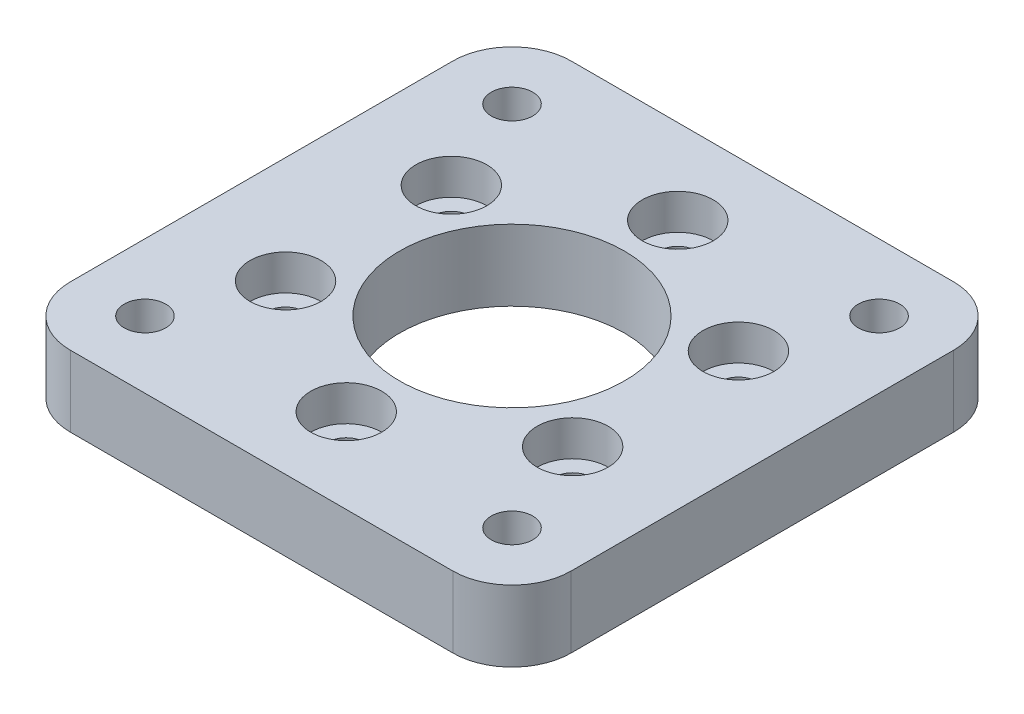
ISO-10303-21;
HEADER;
FILE_DESCRIPTION(('STEP AP214'),'2;1');
FILE_NAME('part.step','',(''),(''),'','','');
FILE_SCHEMA(('AUTOMOTIVE_DESIGN { 1 0 10303 214 1 1 1 1 }'));
ENDSEC;
DATA;
#1=APPLICATION_CONTEXT('core data for automotive mechanical design processes');
#2=APPLICATION_PROTOCOL_DEFINITION('international standard','automotive_design',2000,#1);
#3=PRODUCT_CONTEXT('',#1,'mechanical');
#4=PRODUCT('Part','Part','',(#3));
#5=PRODUCT_RELATED_PRODUCT_CATEGORY('part','',(#4));
#6=PRODUCT_DEFINITION_FORMATION('','',#4);
#7=PRODUCT_DEFINITION_CONTEXT('part definition',#1,'design');
#8=PRODUCT_DEFINITION('design','',#6,#7);
#9=PRODUCT_DEFINITION_SHAPE('','',#8);
#10=(LENGTH_UNIT() NAMED_UNIT(*) SI_UNIT(.MILLI.,.METRE.));
#11=(NAMED_UNIT(*) PLANE_ANGLE_UNIT() SI_UNIT($,.RADIAN.));
#12=(NAMED_UNIT(*) SI_UNIT($,.STERADIAN.) SOLID_ANGLE_UNIT());
#13=UNCERTAINTY_MEASURE_WITH_UNIT(LENGTH_MEASURE(1.E-05),#10,'distance_accuracy_value','');
#14=(GEOMETRIC_REPRESENTATION_CONTEXT(3) GLOBAL_UNCERTAINTY_ASSIGNED_CONTEXT((#13)) GLOBAL_UNIT_ASSIGNED_CONTEXT((#10,
#11,#12)) REPRESENTATION_CONTEXT('',''));
#15=CARTESIAN_POINT('',(0.,0.,0.));
#16=DIRECTION('',(0.,0.,1.));
#17=DIRECTION('',(1.,0.,0.));
#18=AXIS2_PLACEMENT_3D('',#15,#16,#17);
#19=CARTESIAN_POINT('',(-12.1243556529821,-3.,-7.00000000000014));
#20=DIRECTION('',(0.,1.,0.));
#21=DIRECTION('',(0.,0.,1.));
#22=AXIS2_PLACEMENT_3D('',#19,#20,#21);
#23=CYLINDRICAL_SURFACE('',#22,1.55);
#24=CARTESIAN_POINT('',(-12.1243556529821,-3.,-7.00000000000014));
#25=DIRECTION('',(0.,1.,0.));
#26=DIRECTION('',(0.866025403784433,0.,0.50000000000001));
#27=AXIS2_PLACEMENT_3D('',#24,#25,#26);
#28=CIRCLE('',#27,1.55);
#29=CARTESIAN_POINT('',(-10.7820162771162,-3.,-6.22500000000013));
#30=VERTEX_POINT('',#29);
#31=EDGE_CURVE('E168',#30,#30,#28,.T.);
#32=ORIENTED_EDGE('',*,*,#31,.F.);
#33=EDGE_LOOP('',(#32));
#34=FACE_BOUND('',#33,.T.);
#35=CARTESIAN_POINT('',(-12.1243556529821,0.,-7.00000000000014));
#36=DIRECTION('',(0.,1.,0.));
#37=DIRECTION('',(0.,0.,1.));
#38=AXIS2_PLACEMENT_3D('',#35,#36,#37);
#39=CIRCLE('',#38,1.55);
#40=CARTESIAN_POINT('',(-12.1243556529821,0.,-5.45000000000014));
#41=VERTEX_POINT('',#40);
#42=EDGE_CURVE('E40',#41,#41,#39,.F.);
#43=ORIENTED_EDGE('',*,*,#42,.F.);
#44=EDGE_LOOP('',(#43));
#45=FACE_BOUND('',#44,.T.);
#46=ADVANCED_FACE('F36',(#34,#45),#23,.F.);
#47=CARTESIAN_POINT('',(-12.1243556529822,-3.,6.99999999999989));
#48=DIRECTION('',(0.,1.,0.));
#49=DIRECTION('',(0.,0.,1.));
#50=AXIS2_PLACEMENT_3D('',#47,#48,#49);
#51=CYLINDRICAL_SURFACE('',#50,1.55);
#52=CARTESIAN_POINT('',(-12.1243556529822,-3.,6.99999999999989));
#53=DIRECTION('',(0.,1.,0.));
#54=DIRECTION('',(0.866025403784443,0.,-0.499999999999992));
#55=AXIS2_PLACEMENT_3D('',#52,#53,#54);
#56=CIRCLE('',#55,1.55);
#57=CARTESIAN_POINT('',(-10.7820162771163,-3.,6.2249999999999));
#58=VERTEX_POINT('',#57);
#59=EDGE_CURVE('E210',#58,#58,#56,.T.);
#60=ORIENTED_EDGE('',*,*,#59,.F.);
#61=EDGE_LOOP('',(#60));
#62=FACE_BOUND('',#61,.T.);
#63=CARTESIAN_POINT('',(-12.1243556529822,0.,6.99999999999989));
#64=DIRECTION('',(0.,1.,0.));
#65=DIRECTION('',(0.,0.,1.));
#66=AXIS2_PLACEMENT_3D('',#63,#64,#65);
#67=CIRCLE('',#66,1.55);
#68=CARTESIAN_POINT('',(-12.1243556529822,0.,8.54999999999989));
#69=VERTEX_POINT('',#68);
#70=EDGE_CURVE('E179',#69,#69,#67,.F.);
#71=ORIENTED_EDGE('',*,*,#70,.F.);
#72=EDGE_LOOP('',(#71));
#73=FACE_BOUND('',#72,.T.);
#74=ADVANCED_FACE('F287',(#62,#73),#51,.F.);
#75=CARTESIAN_POINT('',(0.,-3.,14.));
#76=DIRECTION('',(0.,1.,0.));
#77=DIRECTION('',(0.,0.,1.));
#78=AXIS2_PLACEMENT_3D('',#75,#76,#77);
#79=CYLINDRICAL_SURFACE('',#78,1.55);
#80=CARTESIAN_POINT('',(0.,-3.,14.));
#81=DIRECTION('',(0.,1.,0.));
#82=DIRECTION('',(0.,0.,-1.));
#83=AXIS2_PLACEMENT_3D('',#80,#81,#82);
#84=CIRCLE('',#83,1.55);
#85=CARTESIAN_POINT('',(0.,-3.,12.45));
#86=VERTEX_POINT('',#85);
#87=EDGE_CURVE('E213',#86,#86,#84,.T.);
#88=ORIENTED_EDGE('',*,*,#87,.F.);
#89=EDGE_LOOP('',(#88));
#90=FACE_BOUND('',#89,.T.);
#91=CARTESIAN_POINT('',(0.,0.,14.));
#92=DIRECTION('',(0.,1.,0.));
#93=DIRECTION('',(0.,0.,1.));
#94=AXIS2_PLACEMENT_3D('',#91,#92,#93);
#95=CIRCLE('',#94,1.55);
#96=CARTESIAN_POINT('',(0.,0.,15.55));
#97=VERTEX_POINT('',#96);
#98=EDGE_CURVE('E175',#97,#97,#95,.F.);
#99=ORIENTED_EDGE('',*,*,#98,.F.);
#100=EDGE_LOOP('',(#99));
#101=FACE_BOUND('',#100,.T.);
#102=ADVANCED_FACE('F293',(#90,#101),#79,.F.);
#103=CARTESIAN_POINT('',(12.1243556529821,-3.,7.00000000000006));
#104=DIRECTION('',(0.,1.,0.));
#105=DIRECTION('',(0.,0.,1.));
#106=AXIS2_PLACEMENT_3D('',#103,#104,#105);
#107=CYLINDRICAL_SURFACE('',#106,1.55);
#108=CARTESIAN_POINT('',(12.1243556529821,-3.,7.00000000000006));
#109=DIRECTION('',(0.,1.,0.));
#110=DIRECTION('',(-0.866025403784436,0.,-0.500000000000004));
#111=AXIS2_PLACEMENT_3D('',#108,#109,#110);
#112=CIRCLE('',#111,1.55);
#113=CARTESIAN_POINT('',(10.7820162771162,-3.,6.22500000000005));
#114=VERTEX_POINT('',#113);
#115=EDGE_CURVE('E216',#114,#114,#112,.T.);
#116=ORIENTED_EDGE('',*,*,#115,.F.);
#117=EDGE_LOOP('',(#116));
#118=FACE_BOUND('',#117,.T.);
#119=CARTESIAN_POINT('',(12.1243556529821,0.,7.00000000000006));
#120=DIRECTION('',(0.,1.,0.));
#121=DIRECTION('',(0.,0.,1.));
#122=AXIS2_PLACEMENT_3D('',#119,#120,#121);
#123=CIRCLE('',#122,1.55);
#124=CARTESIAN_POINT('',(12.1243556529821,0.,8.55000000000006));
#125=VERTEX_POINT('',#124);
#126=EDGE_CURVE('E170',#125,#125,#123,.F.);
#127=ORIENTED_EDGE('',*,*,#126,.F.);
#128=EDGE_LOOP('',(#127));
#129=FACE_BOUND('',#128,.T.);
#130=ADVANCED_FACE('F304',(#118,#129),#107,.F.);
#131=CARTESIAN_POINT('',(12.1243556529822,-3.,-6.99999999999997));
#132=DIRECTION('',(0.,1.,0.));
#133=DIRECTION('',(0.,0.,1.));
#134=AXIS2_PLACEMENT_3D('',#131,#132,#133);
#135=CYLINDRICAL_SURFACE('',#134,1.55);
#136=CARTESIAN_POINT('',(12.1243556529822,-3.,-6.99999999999997));
#137=DIRECTION('',(0.,1.,0.));
#138=DIRECTION('',(-0.86602540378444,0.,0.499999999999998));
#139=AXIS2_PLACEMENT_3D('',#136,#137,#138);
#140=CIRCLE('',#139,1.55);
#141=CARTESIAN_POINT('',(10.7820162771163,-3.,-6.22499999999998));
#142=VERTEX_POINT('',#141);
#143=EDGE_CURVE('E219',#142,#142,#140,.T.);
#144=ORIENTED_EDGE('',*,*,#143,.F.);
#145=EDGE_LOOP('',(#144));
#146=FACE_BOUND('',#145,.T.);
#147=CARTESIAN_POINT('',(12.1243556529822,0.,-6.99999999999997));
#148=DIRECTION('',(0.,1.,0.));
#149=DIRECTION('',(0.,0.,1.));
#150=AXIS2_PLACEMENT_3D('',#147,#148,#149);
#151=CIRCLE('',#150,1.55);
#152=CARTESIAN_POINT('',(12.1243556529822,0.,-5.44999999999997));
#153=VERTEX_POINT('',#152);
#154=EDGE_CURVE('E165',#153,#153,#151,.F.);
#155=ORIENTED_EDGE('',*,*,#154,.F.);
#156=EDGE_LOOP('',(#155));
#157=FACE_BOUND('',#156,.T.);
#158=ADVANCED_FACE('F308',(#146,#157),#135,.F.);
#159=CARTESIAN_POINT('',(0.,-3.,-14.));
#160=DIRECTION('',(0.,1.,0.));
#161=DIRECTION('',(0.,0.,1.));
#162=AXIS2_PLACEMENT_3D('',#159,#160,#161);
#163=CYLINDRICAL_SURFACE('',#162,1.55);
#164=CARTESIAN_POINT('',(0.,-3.,-14.));
#165=DIRECTION('',(0.,1.,0.));
#166=DIRECTION('',(0.,0.,1.));
#167=AXIS2_PLACEMENT_3D('',#164,#165,#166);
#168=CIRCLE('',#167,1.55);
#169=CARTESIAN_POINT('',(0.,-3.,-12.45));
#170=VERTEX_POINT('',#169);
#171=EDGE_CURVE('E163',#170,#170,#168,.T.);
#172=ORIENTED_EDGE('',*,*,#171,.F.);
#173=EDGE_LOOP('',(#172));
#174=FACE_BOUND('',#173,.T.);
#175=CARTESIAN_POINT('',(0.,0.,-14.));
#176=DIRECTION('',(0.,1.,0.));
#177=DIRECTION('',(0.,0.,1.));
#178=AXIS2_PLACEMENT_3D('',#175,#176,#177);
#179=CIRCLE('',#178,1.55);
#180=CARTESIAN_POINT('',(0.,0.,-12.45));
#181=VERTEX_POINT('',#180);
#182=EDGE_CURVE('E160',#181,#181,#179,.F.);
#183=ORIENTED_EDGE('',*,*,#182,.F.);
#184=EDGE_LOOP('',(#183));
#185=FACE_BOUND('',#184,.T.);
#186=ADVANCED_FACE('F312',(#174,#185),#163,.F.);
#187=CARTESIAN_POINT('',(21.15,3.,-21.15));
#188=DIRECTION('',(-1.,0.,0.));
#189=DIRECTION('',(0.,0.,1.));
#190=AXIS2_PLACEMENT_3D('',#187,#188,#189);
#191=PLANE('',#190);
#192=DIRECTION('',(0.,0.,-1.));
#193=VECTOR('',#192,1.);
#194=CARTESIAN_POINT('',(21.15,-3.,-21.15));
#195=LINE('',#194,#193);
#196=CARTESIAN_POINT('',(21.15,-3.,16.15));
#197=VERTEX_POINT('',#196);
#198=CARTESIAN_POINT('',(21.15,-3.,-16.15));
#199=VERTEX_POINT('',#198);
#200=EDGE_CURVE('E257',#197,#199,#195,.T.);
#201=ORIENTED_EDGE('',*,*,#200,.T.);
#202=DIRECTION('',(0.,-1.,0.));
#203=VECTOR('',#202,1.);
#204=CARTESIAN_POINT('',(21.15,3.,-16.15));
#205=LINE('',#204,#203);
#206=CARTESIAN_POINT('',(21.15,3.,-16.15));
#207=VERTEX_POINT('',#206);
#208=EDGE_CURVE('E11',#199,#207,#205,.F.);
#209=ORIENTED_EDGE('',*,*,#208,.T.);
#210=DIRECTION('',(0.,0.,-1.));
#211=VECTOR('',#210,1.);
#212=CARTESIAN_POINT('',(21.15,3.,-21.15));
#213=LINE('',#212,#211);
#214=CARTESIAN_POINT('',(21.15,3.,16.15));
#215=VERTEX_POINT('',#214);
#216=EDGE_CURVE('E130',#215,#207,#213,.T.);
#217=ORIENTED_EDGE('',*,*,#216,.F.);
#218=DIRECTION('',(0.,-1.,0.));
#219=VECTOR('',#218,1.);
#220=CARTESIAN_POINT('',(21.15,3.,16.15));
#221=LINE('',#220,#219);
#222=EDGE_CURVE('E45',#215,#197,#221,.T.);
#223=ORIENTED_EDGE('',*,*,#222,.T.);
#224=EDGE_LOOP('',(#201,#209,#217,#223));
#225=FACE_BOUND('',#224,.T.);
#226=ADVANCED_FACE('F284',(#225),#191,.F.);
#227=CARTESIAN_POINT('',(-21.15,3.,-21.15));
#228=DIRECTION('',(0.,0.,1.));
#229=DIRECTION('',(1.,0.,0.));
#230=AXIS2_PLACEMENT_3D('',#227,#228,#229);
#231=PLANE('',#230);
#232=DIRECTION('',(-1.,0.,0.));
#233=VECTOR('',#232,1.);
#234=CARTESIAN_POINT('',(-21.15,-3.,-21.15));
#235=LINE('',#234,#233);
#236=CARTESIAN_POINT('',(16.15,-3.,-21.15));
#237=VERTEX_POINT('',#236);
#238=CARTESIAN_POINT('',(-16.15,-3.,-21.15));
#239=VERTEX_POINT('',#238);
#240=EDGE_CURVE('E135',#237,#239,#235,.T.);
#241=ORIENTED_EDGE('',*,*,#240,.T.);
#242=DIRECTION('',(0.,-1.,0.));
#243=VECTOR('',#242,1.);
#244=CARTESIAN_POINT('',(-16.15,3.,-21.15));
#245=LINE('',#244,#243);
#246=CARTESIAN_POINT('',(-16.15,3.,-21.15));
#247=VERTEX_POINT('',#246);
#248=EDGE_CURVE('E53',#239,#247,#245,.F.);
#249=ORIENTED_EDGE('',*,*,#248,.T.);
#250=DIRECTION('',(-1.,0.,0.));
#251=VECTOR('',#250,1.);
#252=CARTESIAN_POINT('',(-21.15,3.,-21.15));
#253=LINE('',#252,#251);
#254=CARTESIAN_POINT('',(16.15,3.,-21.15));
#255=VERTEX_POINT('',#254);
#256=EDGE_CURVE('E133',#255,#247,#253,.T.);
#257=ORIENTED_EDGE('',*,*,#256,.F.);
#258=DIRECTION('',(0.,-1.,0.));
#259=VECTOR('',#258,1.);
#260=CARTESIAN_POINT('',(16.15,3.,-21.15));
#261=LINE('',#260,#259);
#262=EDGE_CURVE('E154',#255,#237,#261,.T.);
#263=ORIENTED_EDGE('',*,*,#262,.T.);
#264=EDGE_LOOP('',(#241,#249,#257,#263));
#265=FACE_BOUND('',#264,.T.);
#266=ADVANCED_FACE('F267',(#265),#231,.F.);
#267=CARTESIAN_POINT('',(-21.15,3.,-21.15));
#268=DIRECTION('',(1.,0.,0.));
#269=DIRECTION('',(0.,0.,-1.));
#270=AXIS2_PLACEMENT_3D('',#267,#268,#269);
#271=PLANE('',#270);
#272=DIRECTION('',(0.,0.,1.));
#273=VECTOR('',#272,1.);
#274=CARTESIAN_POINT('',(-21.15,-3.,-21.15));
#275=LINE('',#274,#273);
#276=CARTESIAN_POINT('',(-21.15,-3.,-16.15));
#277=VERTEX_POINT('',#276);
#278=CARTESIAN_POINT('',(-21.15,-3.,16.15));
#279=VERTEX_POINT('',#278);
#280=EDGE_CURVE('E131',#277,#279,#275,.T.);
#281=ORIENTED_EDGE('',*,*,#280,.T.);
#282=DIRECTION('',(0.,-1.,0.));
#283=VECTOR('',#282,1.);
#284=CARTESIAN_POINT('',(-21.15,3.,16.15));
#285=LINE('',#284,#283);
#286=CARTESIAN_POINT('',(-21.15,3.,16.15));
#287=VERTEX_POINT('',#286);
#288=EDGE_CURVE('E109',#279,#287,#285,.F.);
#289=ORIENTED_EDGE('',*,*,#288,.T.);
#290=DIRECTION('',(0.,0.,1.));
#291=VECTOR('',#290,1.);
#292=CARTESIAN_POINT('',(-21.15,3.,-21.15));
#293=LINE('',#292,#291);
#294=CARTESIAN_POINT('',(-21.15,3.,-16.15));
#295=VERTEX_POINT('',#294);
#296=EDGE_CURVE('E261',#295,#287,#293,.T.);
#297=ORIENTED_EDGE('',*,*,#296,.F.);
#298=DIRECTION('',(0.,-1.,0.));
#299=VECTOR('',#298,1.);
#300=CARTESIAN_POINT('',(-21.15,3.,-16.15));
#301=LINE('',#300,#299);
#302=EDGE_CURVE('E114',#295,#277,#301,.T.);
#303=ORIENTED_EDGE('',*,*,#302,.T.);
#304=EDGE_LOOP('',(#281,#289,#297,#303));
#305=FACE_BOUND('',#304,.T.);
#306=ADVANCED_FACE('F276',(#305),#271,.F.);
#307=CARTESIAN_POINT('',(-21.15,3.,21.15));
#308=DIRECTION('',(0.,0.,-1.));
#309=DIRECTION('',(-1.,0.,0.));
#310=AXIS2_PLACEMENT_3D('',#307,#308,#309);
#311=PLANE('',#310);
#312=DIRECTION('',(1.,0.,0.));
#313=VECTOR('',#312,1.);
#314=CARTESIAN_POINT('',(-21.15,3.,21.15));
#315=LINE('',#314,#313);
#316=CARTESIAN_POINT('',(-16.15,3.,21.15));
#317=VERTEX_POINT('',#316);
#318=CARTESIAN_POINT('',(16.15,3.,21.15));
#319=VERTEX_POINT('',#318);
#320=EDGE_CURVE('E124',#317,#319,#315,.T.);
#321=ORIENTED_EDGE('',*,*,#320,.F.);
#322=DIRECTION('',(0.,-1.,0.));
#323=VECTOR('',#322,1.);
#324=CARTESIAN_POINT('',(-16.15,3.,21.15));
#325=LINE('',#324,#323);
#326=CARTESIAN_POINT('',(-16.15,-3.,21.15));
#327=VERTEX_POINT('',#326);
#328=EDGE_CURVE('E108',#317,#327,#325,.T.);
#329=ORIENTED_EDGE('',*,*,#328,.T.);
#330=DIRECTION('',(1.,0.,0.));
#331=VECTOR('',#330,1.);
#332=CARTESIAN_POINT('',(-21.15,-3.,21.15));
#333=LINE('',#332,#331);
#334=CARTESIAN_POINT('',(16.15,-3.,21.15));
#335=VERTEX_POINT('',#334);
#336=EDGE_CURVE('E121',#327,#335,#333,.T.);
#337=ORIENTED_EDGE('',*,*,#336,.T.);
#338=DIRECTION('',(0.,-1.,0.));
#339=VECTOR('',#338,1.);
#340=CARTESIAN_POINT('',(16.15,3.,21.15));
#341=LINE('',#340,#339);
#342=EDGE_CURVE('E126',#335,#319,#341,.F.);
#343=ORIENTED_EDGE('',*,*,#342,.T.);
#344=EDGE_LOOP('',(#321,#329,#337,#343));
#345=FACE_BOUND('',#344,.T.);
#346=ADVANCED_FACE('F120',(#345),#311,.F.);
#347=CARTESIAN_POINT('',(0.,3.,0.));
#348=DIRECTION('',(0.,1.,0.));
#349=DIRECTION('',(0.,0.,1.));
#350=AXIS2_PLACEMENT_3D('',#347,#348,#349);
#351=PLANE('',#350);
#352=CARTESIAN_POINT('',(-12.1243556529821,3.,-7.00000000000014));
#353=DIRECTION('',(0.,1.,0.));
#354=DIRECTION('',(0.866025403784433,0.,0.50000000000001));
#355=AXIS2_PLACEMENT_3D('',#352,#353,#354);
#356=CIRCLE('',#355,3.);
#357=CARTESIAN_POINT('',(-9.52627944162876,3.,-5.50000000000011));
#358=VERTEX_POINT('',#357);
#359=EDGE_CURVE('E195',#358,#358,#356,.T.);
#360=ORIENTED_EDGE('',*,*,#359,.F.);
#361=EDGE_LOOP('',(#360));
#362=FACE_BOUND('',#361,.T.);
#363=CARTESIAN_POINT('',(-12.1243556529822,3.,6.99999999999989));
#364=DIRECTION('',(0.,1.,0.));
#365=DIRECTION('',(0.866025403784443,0.,-0.499999999999992));
#366=AXIS2_PLACEMENT_3D('',#363,#364,#365);
#367=CIRCLE('',#366,3.);
#368=CARTESIAN_POINT('',(-9.52627944162888,3.,5.49999999999991));
#369=VERTEX_POINT('',#368);
#370=EDGE_CURVE('E188',#369,#369,#367,.T.);
#371=ORIENTED_EDGE('',*,*,#370,.F.);
#372=EDGE_LOOP('',(#371));
#373=FACE_BOUND('',#372,.T.);
#374=CARTESIAN_POINT('',(0.,3.,14.));
#375=DIRECTION('',(0.,1.,0.));
#376=DIRECTION('',(0.,0.,-1.));
#377=AXIS2_PLACEMENT_3D('',#374,#375,#376);
#378=CIRCLE('',#377,3.);
#379=CARTESIAN_POINT('',(0.,3.,11.));
#380=VERTEX_POINT('',#379);
#381=EDGE_CURVE('E181',#380,#380,#378,.T.);
#382=ORIENTED_EDGE('',*,*,#381,.F.);
#383=EDGE_LOOP('',(#382));
#384=FACE_BOUND('',#383,.T.);
#385=CARTESIAN_POINT('',(12.1243556529821,3.,7.00000000000006));
#386=DIRECTION('',(0.,1.,0.));
#387=DIRECTION('',(-0.866025403784436,0.,-0.500000000000004));
#388=AXIS2_PLACEMENT_3D('',#385,#386,#387);
#389=CIRCLE('',#388,3.);
#390=CARTESIAN_POINT('',(9.5262794416288,3.,5.50000000000004));
#391=VERTEX_POINT('',#390);
#392=EDGE_CURVE('E177',#391,#391,#389,.T.);
#393=ORIENTED_EDGE('',*,*,#392,.F.);
#394=EDGE_LOOP('',(#393));
#395=FACE_BOUND('',#394,.T.);
#396=CARTESIAN_POINT('',(12.1243556529822,3.,-6.99999999999997));
#397=DIRECTION('',(0.,1.,0.));
#398=DIRECTION('',(-0.86602540378444,0.,0.499999999999998));
#399=AXIS2_PLACEMENT_3D('',#396,#397,#398);
#400=CIRCLE('',#399,3.);
#401=CARTESIAN_POINT('',(9.52627944162884,3.,-5.49999999999998));
#402=VERTEX_POINT('',#401);
#403=EDGE_CURVE('E173',#402,#402,#400,.T.);
#404=ORIENTED_EDGE('',*,*,#403,.F.);
#405=EDGE_LOOP('',(#404));
#406=FACE_BOUND('',#405,.T.);
#407=CARTESIAN_POINT('',(0.,3.,-14.));
#408=DIRECTION('',(0.,1.,0.));
#409=DIRECTION('',(0.,0.,1.));
#410=AXIS2_PLACEMENT_3D('',#407,#408,#409);
#411=CIRCLE('',#410,3.);
#412=CARTESIAN_POINT('',(0.,3.,-11.));
#413=VERTEX_POINT('',#412);
#414=EDGE_CURVE('E222',#413,#413,#411,.T.);
#415=ORIENTED_EDGE('',*,*,#414,.F.);
#416=EDGE_LOOP('',(#415));
#417=FACE_BOUND('',#416,.T.);
#418=CARTESIAN_POINT('',(0.,3.,0.));
#419=DIRECTION('',(0.,-1.,0.));
#420=DIRECTION('',(0.,0.,-1.));
#421=AXIS2_PLACEMENT_3D('',#418,#419,#420);
#422=CIRCLE('',#421,9.5);
#423=CARTESIAN_POINT('',(0.,3.,-9.5));
#424=VERTEX_POINT('',#423);
#425=EDGE_CURVE('E230',#424,#424,#422,.T.);
#426=ORIENTED_EDGE('',*,*,#425,.T.);
#427=EDGE_LOOP('',(#426));
#428=FACE_BOUND('',#427,.T.);
#429=CARTESIAN_POINT('',(-15.5,3.,-15.5));
#430=DIRECTION('',(0.,-1.,0.));
#431=DIRECTION('',(0.,0.,-1.));
#432=AXIS2_PLACEMENT_3D('',#429,#430,#431);
#433=CIRCLE('',#432,1.75);
#434=CARTESIAN_POINT('',(-15.5,3.,-17.25));
#435=VERTEX_POINT('',#434);
#436=EDGE_CURVE('E236',#435,#435,#433,.T.);
#437=ORIENTED_EDGE('',*,*,#436,.T.);
#438=EDGE_LOOP('',(#437));
#439=FACE_BOUND('',#438,.T.);
#440=CARTESIAN_POINT('',(15.5,3.,-15.5));
#441=DIRECTION('',(0.,-1.,0.));
#442=DIRECTION('',(0.,0.,-1.));
#443=AXIS2_PLACEMENT_3D('',#440,#441,#442);
#444=CIRCLE('',#443,1.75);
#445=CARTESIAN_POINT('',(15.5,3.,-17.25));
#446=VERTEX_POINT('',#445);
#447=EDGE_CURVE('E242',#446,#446,#444,.T.);
#448=ORIENTED_EDGE('',*,*,#447,.T.);
#449=EDGE_LOOP('',(#448));
#450=FACE_BOUND('',#449,.T.);
#451=CARTESIAN_POINT('',(15.5,3.,15.5));
#452=DIRECTION('',(0.,-1.,0.));
#453=DIRECTION('',(0.,0.,-1.));
#454=AXIS2_PLACEMENT_3D('',#451,#452,#453);
#455=CIRCLE('',#454,1.75);
#456=CARTESIAN_POINT('',(15.5,3.,13.75));
#457=VERTEX_POINT('',#456);
#458=EDGE_CURVE('E248',#457,#457,#455,.T.);
#459=ORIENTED_EDGE('',*,*,#458,.T.);
#460=EDGE_LOOP('',(#459));
#461=FACE_BOUND('',#460,.T.);
#462=CARTESIAN_POINT('',(-15.5,3.,15.5));
#463=DIRECTION('',(0.,-1.,0.));
#464=DIRECTION('',(0.,0.,-1.));
#465=AXIS2_PLACEMENT_3D('',#462,#463,#464);
#466=CIRCLE('',#465,1.75);
#467=CARTESIAN_POINT('',(-15.5,3.,13.75));
#468=VERTEX_POINT('',#467);
#469=EDGE_CURVE('E254',#468,#468,#466,.T.);
#470=ORIENTED_EDGE('',*,*,#469,.T.);
#471=EDGE_LOOP('',(#470));
#472=FACE_BOUND('',#471,.T.);
#473=ORIENTED_EDGE('',*,*,#296,.T.);
#474=CARTESIAN_POINT('',(-16.15,3.,16.15));
#475=DIRECTION('',(0.,1.,0.));
#476=DIRECTION('',(0.,0.,1.));
#477=AXIS2_PLACEMENT_3D('',#474,#475,#476);
#478=CIRCLE('',#477,5.);
#479=EDGE_CURVE('E152',#287,#317,#478,.T.);
#480=ORIENTED_EDGE('',*,*,#479,.T.);
#481=ORIENTED_EDGE('',*,*,#320,.T.);
#482=CARTESIAN_POINT('',(16.15,3.,16.15));
#483=DIRECTION('',(0.,1.,0.));
#484=DIRECTION('',(0.,0.,1.));
#485=AXIS2_PLACEMENT_3D('',#482,#483,#484);
#486=CIRCLE('',#485,5.);
#487=EDGE_CURVE('E147',#319,#215,#486,.T.);
#488=ORIENTED_EDGE('',*,*,#487,.T.);
#489=ORIENTED_EDGE('',*,*,#216,.T.);
#490=CARTESIAN_POINT('',(16.15,3.,-16.15));
#491=DIRECTION('',(0.,1.,0.));
#492=DIRECTION('',(0.,0.,1.));
#493=AXIS2_PLACEMENT_3D('',#490,#491,#492);
#494=CIRCLE('',#493,5.);
#495=EDGE_CURVE('E60',#207,#255,#494,.T.);
#496=ORIENTED_EDGE('',*,*,#495,.T.);
#497=ORIENTED_EDGE('',*,*,#256,.T.);
#498=CARTESIAN_POINT('',(-16.15,3.,-16.15));
#499=DIRECTION('',(0.,1.,0.));
#500=DIRECTION('',(0.,0.,1.));
#501=AXIS2_PLACEMENT_3D('',#498,#499,#500);
#502=CIRCLE('',#501,5.);
#503=EDGE_CURVE('E150',#247,#295,#502,.T.);
#504=ORIENTED_EDGE('',*,*,#503,.T.);
#505=EDGE_LOOP('',(#473,#480,#481,#488,#489,#496,#497,#504));
#506=FACE_BOUND('',#505,.T.);
#507=ADVANCED_FACE('F274',(#362,#373,#384,#395,#406,#417,#428,#439,#450,#461,#472,#506),#351,.T.);
#508=CARTESIAN_POINT('',(0.,-3.,0.));
#509=DIRECTION('',(0.,1.,0.));
#510=DIRECTION('',(0.,0.,1.));
#511=AXIS2_PLACEMENT_3D('',#508,#509,#510);
#512=PLANE('',#511);
#513=ORIENTED_EDGE('',*,*,#31,.T.);
#514=EDGE_LOOP('',(#513));
#515=FACE_BOUND('',#514,.T.);
#516=ORIENTED_EDGE('',*,*,#59,.T.);
#517=EDGE_LOOP('',(#516));
#518=FACE_BOUND('',#517,.T.);
#519=ORIENTED_EDGE('',*,*,#87,.T.);
#520=EDGE_LOOP('',(#519));
#521=FACE_BOUND('',#520,.T.);
#522=ORIENTED_EDGE('',*,*,#115,.T.);
#523=EDGE_LOOP('',(#522));
#524=FACE_BOUND('',#523,.T.);
#525=ORIENTED_EDGE('',*,*,#143,.T.);
#526=EDGE_LOOP('',(#525));
#527=FACE_BOUND('',#526,.T.);
#528=ORIENTED_EDGE('',*,*,#171,.T.);
#529=EDGE_LOOP('',(#528));
#530=FACE_BOUND('',#529,.T.);
#531=CARTESIAN_POINT('',(0.,-3.,0.));
#532=DIRECTION('',(0.,-1.,0.));
#533=DIRECTION('',(0.,0.,-1.));
#534=AXIS2_PLACEMENT_3D('',#531,#532,#533);
#535=CIRCLE('',#534,9.5);
#536=CARTESIAN_POINT('',(0.,-3.,-9.5));
#537=VERTEX_POINT('',#536);
#538=EDGE_CURVE('E229',#537,#537,#535,.T.);
#539=ORIENTED_EDGE('',*,*,#538,.F.);
#540=EDGE_LOOP('',(#539));
#541=FACE_BOUND('',#540,.T.);
#542=CARTESIAN_POINT('',(-15.5,-3.,-15.5));
#543=DIRECTION('',(0.,-1.,0.));
#544=DIRECTION('',(0.,0.,-1.));
#545=AXIS2_PLACEMENT_3D('',#542,#543,#544);
#546=CIRCLE('',#545,1.75);
#547=CARTESIAN_POINT('',(-15.5,-3.,-17.25));
#548=VERTEX_POINT('',#547);
#549=EDGE_CURVE('E233',#548,#548,#546,.T.);
#550=ORIENTED_EDGE('',*,*,#549,.F.);
#551=EDGE_LOOP('',(#550));
#552=FACE_BOUND('',#551,.T.);
#553=CARTESIAN_POINT('',(15.5,-3.,-15.5));
#554=DIRECTION('',(0.,-1.,0.));
#555=DIRECTION('',(0.,0.,-1.));
#556=AXIS2_PLACEMENT_3D('',#553,#554,#555);
#557=CIRCLE('',#556,1.75);
#558=CARTESIAN_POINT('',(15.5,-3.,-17.25));
#559=VERTEX_POINT('',#558);
#560=EDGE_CURVE('E239',#559,#559,#557,.T.);
#561=ORIENTED_EDGE('',*,*,#560,.F.);
#562=EDGE_LOOP('',(#561));
#563=FACE_BOUND('',#562,.T.);
#564=CARTESIAN_POINT('',(15.5,-3.,15.5));
#565=DIRECTION('',(0.,-1.,0.));
#566=DIRECTION('',(0.,0.,-1.));
#567=AXIS2_PLACEMENT_3D('',#564,#565,#566);
#568=CIRCLE('',#567,1.75);
#569=CARTESIAN_POINT('',(15.5,-3.,13.75));
#570=VERTEX_POINT('',#569);
#571=EDGE_CURVE('E245',#570,#570,#568,.T.);
#572=ORIENTED_EDGE('',*,*,#571,.F.);
#573=EDGE_LOOP('',(#572));
#574=FACE_BOUND('',#573,.T.);
#575=CARTESIAN_POINT('',(-15.5,-3.,15.5));
#576=DIRECTION('',(0.,-1.,0.));
#577=DIRECTION('',(0.,0.,-1.));
#578=AXIS2_PLACEMENT_3D('',#575,#576,#577);
#579=CIRCLE('',#578,1.75);
#580=CARTESIAN_POINT('',(-15.5,-3.,13.75));
#581=VERTEX_POINT('',#580);
#582=EDGE_CURVE('E251',#581,#581,#579,.T.);
#583=ORIENTED_EDGE('',*,*,#582,.F.);
#584=EDGE_LOOP('',(#583));
#585=FACE_BOUND('',#584,.T.);
#586=ORIENTED_EDGE('',*,*,#336,.F.);
#587=CARTESIAN_POINT('',(-16.15,-3.,16.15));
#588=DIRECTION('',(0.,1.,0.));
#589=DIRECTION('',(0.,0.,1.));
#590=AXIS2_PLACEMENT_3D('',#587,#588,#589);
#591=CIRCLE('',#590,5.);
#592=EDGE_CURVE('E104',#327,#279,#591,.F.);
#593=ORIENTED_EDGE('',*,*,#592,.T.);
#594=ORIENTED_EDGE('',*,*,#280,.F.);
#595=CARTESIAN_POINT('',(-16.15,-3.,-16.15));
#596=DIRECTION('',(0.,1.,0.));
#597=DIRECTION('',(0.,0.,1.));
#598=AXIS2_PLACEMENT_3D('',#595,#596,#597);
#599=CIRCLE('',#598,5.);
#600=EDGE_CURVE('E115',#277,#239,#599,.F.);
#601=ORIENTED_EDGE('',*,*,#600,.T.);
#602=ORIENTED_EDGE('',*,*,#240,.F.);
#603=CARTESIAN_POINT('',(16.15,-3.,-16.15));
#604=DIRECTION('',(0.,1.,0.));
#605=DIRECTION('',(0.,0.,1.));
#606=AXIS2_PLACEMENT_3D('',#603,#604,#605);
#607=CIRCLE('',#606,5.);
#608=EDGE_CURVE('E141',#237,#199,#607,.F.);
#609=ORIENTED_EDGE('',*,*,#608,.T.);
#610=ORIENTED_EDGE('',*,*,#200,.F.);
#611=CARTESIAN_POINT('',(16.15,-3.,16.15));
#612=DIRECTION('',(0.,1.,0.));
#613=DIRECTION('',(0.,0.,1.));
#614=AXIS2_PLACEMENT_3D('',#611,#612,#613);
#615=CIRCLE('',#614,5.);
#616=EDGE_CURVE('E125',#197,#335,#615,.F.);
#617=ORIENTED_EDGE('',*,*,#616,.T.);
#618=EDGE_LOOP('',(#586,#593,#594,#601,#602,#609,#610,#617));
#619=FACE_BOUND('',#618,.T.);
#620=ADVANCED_FACE('F128',(#515,#518,#521,#524,#527,#530,#541,#552,#563,#574,#585,#619),#512,.F.);
#621=CARTESIAN_POINT('',(-16.15,3.,16.15));
#622=DIRECTION('',(0.,-1.,0.));
#623=DIRECTION('',(0.,0.,-1.));
#624=AXIS2_PLACEMENT_3D('',#621,#622,#623);
#625=CYLINDRICAL_SURFACE('',#624,5.);
#626=ORIENTED_EDGE('',*,*,#479,.F.);
#627=ORIENTED_EDGE('',*,*,#288,.F.);
#628=ORIENTED_EDGE('',*,*,#592,.F.);
#629=ORIENTED_EDGE('',*,*,#328,.F.);
#630=EDGE_LOOP('',(#626,#627,#628,#629));
#631=FACE_BOUND('',#630,.T.);
#632=ADVANCED_FACE('F107',(#631),#625,.T.);
#633=CARTESIAN_POINT('',(-16.15,3.,-16.15));
#634=DIRECTION('',(0.,-1.,0.));
#635=DIRECTION('',(0.,0.,-1.));
#636=AXIS2_PLACEMENT_3D('',#633,#634,#635);
#637=CYLINDRICAL_SURFACE('',#636,5.);
#638=ORIENTED_EDGE('',*,*,#503,.F.);
#639=ORIENTED_EDGE('',*,*,#248,.F.);
#640=ORIENTED_EDGE('',*,*,#600,.F.);
#641=ORIENTED_EDGE('',*,*,#302,.F.);
#642=EDGE_LOOP('',(#638,#639,#640,#641));
#643=FACE_BOUND('',#642,.T.);
#644=ADVANCED_FACE('F271',(#643),#637,.T.);
#645=CARTESIAN_POINT('',(16.15,3.,-16.15));
#646=DIRECTION('',(0.,-1.,0.));
#647=DIRECTION('',(0.,0.,-1.));
#648=AXIS2_PLACEMENT_3D('',#645,#646,#647);
#649=CYLINDRICAL_SURFACE('',#648,5.);
#650=ORIENTED_EDGE('',*,*,#495,.F.);
#651=ORIENTED_EDGE('',*,*,#208,.F.);
#652=ORIENTED_EDGE('',*,*,#608,.F.);
#653=ORIENTED_EDGE('',*,*,#262,.F.);
#654=EDGE_LOOP('',(#650,#651,#652,#653));
#655=FACE_BOUND('',#654,.T.);
#656=ADVANCED_FACE('F580',(#655),#649,.T.);
#657=CARTESIAN_POINT('',(16.15,3.,16.15));
#658=DIRECTION('',(0.,-1.,0.));
#659=DIRECTION('',(0.,0.,-1.));
#660=AXIS2_PLACEMENT_3D('',#657,#658,#659);
#661=CYLINDRICAL_SURFACE('',#660,5.);
#662=ORIENTED_EDGE('',*,*,#487,.F.);
#663=ORIENTED_EDGE('',*,*,#342,.F.);
#664=ORIENTED_EDGE('',*,*,#616,.F.);
#665=ORIENTED_EDGE('',*,*,#222,.F.);
#666=EDGE_LOOP('',(#662,#663,#664,#665));
#667=FACE_BOUND('',#666,.T.);
#668=ADVANCED_FACE('F38',(#667),#661,.T.);
#669=CARTESIAN_POINT('',(-15.5,3.,15.5));
#670=DIRECTION('',(0.,-1.,0.));
#671=DIRECTION('',(0.,0.,-1.));
#672=AXIS2_PLACEMENT_3D('',#669,#670,#671);
#673=CYLINDRICAL_SURFACE('',#672,1.75);
#674=ORIENTED_EDGE('',*,*,#469,.F.);
#675=EDGE_LOOP('',(#674));
#676=FACE_BOUND('',#675,.T.);
#677=ORIENTED_EDGE('',*,*,#582,.T.);
#678=EDGE_LOOP('',(#677));
#679=FACE_BOUND('',#678,.T.);
#680=ADVANCED_FACE('F341',(#676,#679),#673,.F.);
#681=CARTESIAN_POINT('',(15.5,3.,15.5));
#682=DIRECTION('',(0.,-1.,0.));
#683=DIRECTION('',(0.,0.,-1.));
#684=AXIS2_PLACEMENT_3D('',#681,#682,#683);
#685=CYLINDRICAL_SURFACE('',#684,1.75);
#686=ORIENTED_EDGE('',*,*,#458,.F.);
#687=EDGE_LOOP('',(#686));
#688=FACE_BOUND('',#687,.T.);
#689=ORIENTED_EDGE('',*,*,#571,.T.);
#690=EDGE_LOOP('',(#689));
#691=FACE_BOUND('',#690,.T.);
#692=ADVANCED_FACE('F337',(#688,#691),#685,.F.);
#693=CARTESIAN_POINT('',(15.5,3.,-15.5));
#694=DIRECTION('',(0.,-1.,0.));
#695=DIRECTION('',(0.,0.,-1.));
#696=AXIS2_PLACEMENT_3D('',#693,#694,#695);
#697=CYLINDRICAL_SURFACE('',#696,1.75);
#698=ORIENTED_EDGE('',*,*,#447,.F.);
#699=EDGE_LOOP('',(#698));
#700=FACE_BOUND('',#699,.T.);
#701=ORIENTED_EDGE('',*,*,#560,.T.);
#702=EDGE_LOOP('',(#701));
#703=FACE_BOUND('',#702,.T.);
#704=ADVANCED_FACE('F333',(#700,#703),#697,.F.);
#705=CARTESIAN_POINT('',(-15.5,3.,-15.5));
#706=DIRECTION('',(0.,-1.,0.));
#707=DIRECTION('',(0.,0.,-1.));
#708=AXIS2_PLACEMENT_3D('',#705,#706,#707);
#709=CYLINDRICAL_SURFACE('',#708,1.75);
#710=ORIENTED_EDGE('',*,*,#436,.F.);
#711=EDGE_LOOP('',(#710));
#712=FACE_BOUND('',#711,.T.);
#713=ORIENTED_EDGE('',*,*,#549,.T.);
#714=EDGE_LOOP('',(#713));
#715=FACE_BOUND('',#714,.T.);
#716=ADVANCED_FACE('F329',(#712,#715),#709,.F.);
#717=CARTESIAN_POINT('',(0.,3.,0.));
#718=DIRECTION('',(0.,-1.,0.));
#719=DIRECTION('',(0.,0.,-1.));
#720=AXIS2_PLACEMENT_3D('',#717,#718,#719);
#721=CYLINDRICAL_SURFACE('',#720,9.5);
#722=ORIENTED_EDGE('',*,*,#425,.F.);
#723=EDGE_LOOP('',(#722));
#724=FACE_BOUND('',#723,.T.);
#725=ORIENTED_EDGE('',*,*,#538,.T.);
#726=EDGE_LOOP('',(#725));
#727=FACE_BOUND('',#726,.T.);
#728=ADVANCED_FACE('F318',(#724,#727),#721,.F.);
#729=CARTESIAN_POINT('',(0.,0.,-14.));
#730=DIRECTION('',(0.,1.,0.));
#731=DIRECTION('',(0.,0.,1.));
#732=AXIS2_PLACEMENT_3D('',#729,#730,#731);
#733=PLANE('',#732);
#734=CARTESIAN_POINT('',(0.,0.,-14.));
#735=DIRECTION('',(0.,1.,0.));
#736=DIRECTION('',(0.,0.,1.));
#737=AXIS2_PLACEMENT_3D('',#734,#735,#736);
#738=CIRCLE('',#737,3.);
#739=CARTESIAN_POINT('',(0.,0.,-11.));
#740=VERTEX_POINT('',#739);
#741=EDGE_CURVE('E164',#740,#740,#738,.T.);
#742=ORIENTED_EDGE('',*,*,#741,.T.);
#743=EDGE_LOOP('',(#742));
#744=FACE_BOUND('',#743,.T.);
#745=ORIENTED_EDGE('',*,*,#182,.T.);
#746=EDGE_LOOP('',(#745));
#747=FACE_BOUND('',#746,.T.);
#748=ADVANCED_FACE('F314',(#744,#747),#733,.T.);
#749=CARTESIAN_POINT('',(0.,0.,-14.));
#750=DIRECTION('',(0.,1.,0.));
#751=DIRECTION('',(0.,0.,1.));
#752=AXIS2_PLACEMENT_3D('',#749,#750,#751);
#753=CYLINDRICAL_SURFACE('',#752,3.);
#754=ORIENTED_EDGE('',*,*,#741,.F.);
#755=EDGE_LOOP('',(#754));
#756=FACE_BOUND('',#755,.T.);
#757=ORIENTED_EDGE('',*,*,#414,.T.);
#758=EDGE_LOOP('',(#757));
#759=FACE_BOUND('',#758,.T.);
#760=ADVANCED_FACE('F317',(#756,#759),#753,.F.);
#761=CARTESIAN_POINT('',(12.1243556529822,0.,-6.99999999999997));
#762=DIRECTION('',(0.,1.,0.));
#763=DIRECTION('',(-0.86602540378444,0.,0.499999999999998));
#764=AXIS2_PLACEMENT_3D('',#761,#762,#763);
#765=PLANE('',#764);
#766=CARTESIAN_POINT('',(12.1243556529822,0.,-6.99999999999997));
#767=DIRECTION('',(0.,1.,0.));
#768=DIRECTION('',(-0.86602540378444,0.,0.499999999999998));
#769=AXIS2_PLACEMENT_3D('',#766,#767,#768);
#770=CIRCLE('',#769,3.);
#771=CARTESIAN_POINT('',(9.52627944162884,0.,-5.49999999999998));
#772=VERTEX_POINT('',#771);
#773=EDGE_CURVE('E169',#772,#772,#770,.T.);
#774=ORIENTED_EDGE('',*,*,#773,.T.);
#775=EDGE_LOOP('',(#774));
#776=FACE_BOUND('',#775,.T.);
#777=ORIENTED_EDGE('',*,*,#154,.T.);
#778=EDGE_LOOP('',(#777));
#779=FACE_BOUND('',#778,.T.);
#780=ADVANCED_FACE('F322',(#776,#779),#765,.T.);
#781=CARTESIAN_POINT('',(12.1243556529822,0.,-6.99999999999997));
#782=DIRECTION('',(0.,1.,0.));
#783=DIRECTION('',(0.,0.,1.));
#784=AXIS2_PLACEMENT_3D('',#781,#782,#783);
#785=CYLINDRICAL_SURFACE('',#784,3.);
#786=ORIENTED_EDGE('',*,*,#773,.F.);
#787=EDGE_LOOP('',(#786));
#788=FACE_BOUND('',#787,.T.);
#789=ORIENTED_EDGE('',*,*,#403,.T.);
#790=EDGE_LOOP('',(#789));
#791=FACE_BOUND('',#790,.T.);
#792=ADVANCED_FACE('F299',(#788,#791),#785,.F.);
#793=CARTESIAN_POINT('',(12.1243556529821,0.,7.00000000000006));
#794=DIRECTION('',(0.,1.,0.));
#795=DIRECTION('',(-0.866025403784436,0.,-0.500000000000004));
#796=AXIS2_PLACEMENT_3D('',#793,#794,#795);
#797=PLANE('',#796);
#798=CARTESIAN_POINT('',(12.1243556529821,0.,7.00000000000006));
#799=DIRECTION('',(0.,1.,0.));
#800=DIRECTION('',(-0.866025403784436,0.,-0.500000000000004));
#801=AXIS2_PLACEMENT_3D('',#798,#799,#800);
#802=CIRCLE('',#801,3.);
#803=CARTESIAN_POINT('',(9.5262794416288,0.,5.50000000000004));
#804=VERTEX_POINT('',#803);
#805=EDGE_CURVE('E174',#804,#804,#802,.T.);
#806=ORIENTED_EDGE('',*,*,#805,.T.);
#807=EDGE_LOOP('',(#806));
#808=FACE_BOUND('',#807,.T.);
#809=ORIENTED_EDGE('',*,*,#126,.T.);
#810=EDGE_LOOP('',(#809));
#811=FACE_BOUND('',#810,.T.);
#812=ADVANCED_FACE('F391',(#808,#811),#797,.T.);
#813=CARTESIAN_POINT('',(12.1243556529821,0.,7.00000000000006));
#814=DIRECTION('',(0.,1.,0.));
#815=DIRECTION('',(0.,0.,1.));
#816=AXIS2_PLACEMENT_3D('',#813,#814,#815);
#817=CYLINDRICAL_SURFACE('',#816,3.);
#818=ORIENTED_EDGE('',*,*,#805,.F.);
#819=EDGE_LOOP('',(#818));
#820=FACE_BOUND('',#819,.T.);
#821=ORIENTED_EDGE('',*,*,#392,.T.);
#822=EDGE_LOOP('',(#821));
#823=FACE_BOUND('',#822,.T.);
#824=ADVANCED_FACE('F394',(#820,#823),#817,.F.);
#825=CARTESIAN_POINT('',(0.,0.,14.));
#826=DIRECTION('',(0.,1.,0.));
#827=DIRECTION('',(0.,0.,-1.));
#828=AXIS2_PLACEMENT_3D('',#825,#826,#827);
#829=PLANE('',#828);
#830=CARTESIAN_POINT('',(0.,0.,14.));
#831=DIRECTION('',(0.,1.,0.));
#832=DIRECTION('',(0.,0.,-1.));
#833=AXIS2_PLACEMENT_3D('',#830,#831,#832);
#834=CIRCLE('',#833,3.);
#835=CARTESIAN_POINT('',(0.,0.,11.));
#836=VERTEX_POINT('',#835);
#837=EDGE_CURVE('E178',#836,#836,#834,.T.);
#838=ORIENTED_EDGE('',*,*,#837,.T.);
#839=EDGE_LOOP('',(#838));
#840=FACE_BOUND('',#839,.T.);
#841=ORIENTED_EDGE('',*,*,#98,.T.);
#842=EDGE_LOOP('',(#841));
#843=FACE_BOUND('',#842,.T.);
#844=ADVANCED_FACE('F397',(#840,#843),#829,.T.);
#845=CARTESIAN_POINT('',(0.,0.,14.));
#846=DIRECTION('',(0.,1.,0.));
#847=DIRECTION('',(0.,0.,1.));
#848=AXIS2_PLACEMENT_3D('',#845,#846,#847);
#849=CYLINDRICAL_SURFACE('',#848,3.);
#850=ORIENTED_EDGE('',*,*,#837,.F.);
#851=EDGE_LOOP('',(#850));
#852=FACE_BOUND('',#851,.T.);
#853=ORIENTED_EDGE('',*,*,#381,.T.);
#854=EDGE_LOOP('',(#853));
#855=FACE_BOUND('',#854,.T.);
#856=ADVANCED_FACE('F402',(#852,#855),#849,.F.);
#857=CARTESIAN_POINT('',(-12.1243556529822,0.,6.99999999999989));
#858=DIRECTION('',(0.,1.,0.));
#859=DIRECTION('',(0.866025403784443,0.,-0.499999999999992));
#860=AXIS2_PLACEMENT_3D('',#857,#858,#859);
#861=PLANE('',#860);
#862=CARTESIAN_POINT('',(-12.1243556529822,0.,6.99999999999989));
#863=DIRECTION('',(0.,1.,0.));
#864=DIRECTION('',(0.866025403784443,0.,-0.499999999999992));
#865=AXIS2_PLACEMENT_3D('',#862,#863,#864);
#866=CIRCLE('',#865,3.);
#867=CARTESIAN_POINT('',(-9.52627944162888,0.,5.49999999999991));
#868=VERTEX_POINT('',#867);
#869=EDGE_CURVE('E182',#868,#868,#866,.T.);
#870=ORIENTED_EDGE('',*,*,#869,.T.);
#871=EDGE_LOOP('',(#870));
#872=FACE_BOUND('',#871,.T.);
#873=ORIENTED_EDGE('',*,*,#70,.T.);
#874=EDGE_LOOP('',(#873));
#875=FACE_BOUND('',#874,.T.);
#876=ADVANCED_FACE('F405',(#872,#875),#861,.T.);
#877=CARTESIAN_POINT('',(-12.1243556529822,0.,6.99999999999989));
#878=DIRECTION('',(0.,1.,0.));
#879=DIRECTION('',(0.,0.,1.));
#880=AXIS2_PLACEMENT_3D('',#877,#878,#879);
#881=CYLINDRICAL_SURFACE('',#880,3.);
#882=ORIENTED_EDGE('',*,*,#869,.F.);
#883=EDGE_LOOP('',(#882));
#884=FACE_BOUND('',#883,.T.);
#885=ORIENTED_EDGE('',*,*,#370,.T.);
#886=EDGE_LOOP('',(#885));
#887=FACE_BOUND('',#886,.T.);
#888=ADVANCED_FACE('F410',(#884,#887),#881,.F.);
#889=CARTESIAN_POINT('',(-12.1243556529821,0.,-7.00000000000014));
#890=DIRECTION('',(0.,1.,0.));
#891=DIRECTION('',(0.866025403784433,0.,0.50000000000001));
#892=AXIS2_PLACEMENT_3D('',#889,#890,#891);
#893=PLANE('',#892);
#894=CARTESIAN_POINT('',(-12.1243556529821,0.,-7.00000000000014));
#895=DIRECTION('',(0.,1.,0.));
#896=DIRECTION('',(0.866025403784433,0.,0.50000000000001));
#897=AXIS2_PLACEMENT_3D('',#894,#895,#896);
#898=CIRCLE('',#897,3.);
#899=CARTESIAN_POINT('',(-9.52627944162876,0.,-5.50000000000011));
#900=VERTEX_POINT('',#899);
#901=EDGE_CURVE('E428',#900,#900,#898,.T.);
#902=ORIENTED_EDGE('',*,*,#901,.T.);
#903=EDGE_LOOP('',(#902));
#904=FACE_BOUND('',#903,.T.);
#905=ORIENTED_EDGE('',*,*,#42,.T.);
#906=EDGE_LOOP('',(#905));
#907=FACE_BOUND('',#906,.T.);
#908=ADVANCED_FACE('F413',(#904,#907),#893,.T.);
#909=CARTESIAN_POINT('',(-12.1243556529821,0.,-7.00000000000014));
#910=DIRECTION('',(0.,1.,0.));
#911=DIRECTION('',(0.,0.,1.));
#912=AXIS2_PLACEMENT_3D('',#909,#910,#911);
#913=CYLINDRICAL_SURFACE('',#912,3.);
#914=ORIENTED_EDGE('',*,*,#901,.F.);
#915=EDGE_LOOP('',(#914));
#916=FACE_BOUND('',#915,.T.);
#917=ORIENTED_EDGE('',*,*,#359,.T.);
#918=EDGE_LOOP('',(#917));
#919=FACE_BOUND('',#918,.T.);
#920=ADVANCED_FACE('F417',(#916,#919),#913,.F.);
#921=CLOSED_SHELL('',(#46,#74,#102,#130,#158,#186,#226,#266,#306,#346,#507,#620,#632,#644,#656,
#668,#680,#692,#704,#716,#728,#748,#760,#780,#792,#812,#824,#844,#856,#876,#888,#908,#920));
#922=MANIFOLD_SOLID_BREP('B2',#921);
#923=ADVANCED_BREP_SHAPE_REPRESENTATION('',(#18,#922),#14);
#924=SHAPE_DEFINITION_REPRESENTATION(#9,#923);
ENDSEC;
END-ISO-10303-21;
